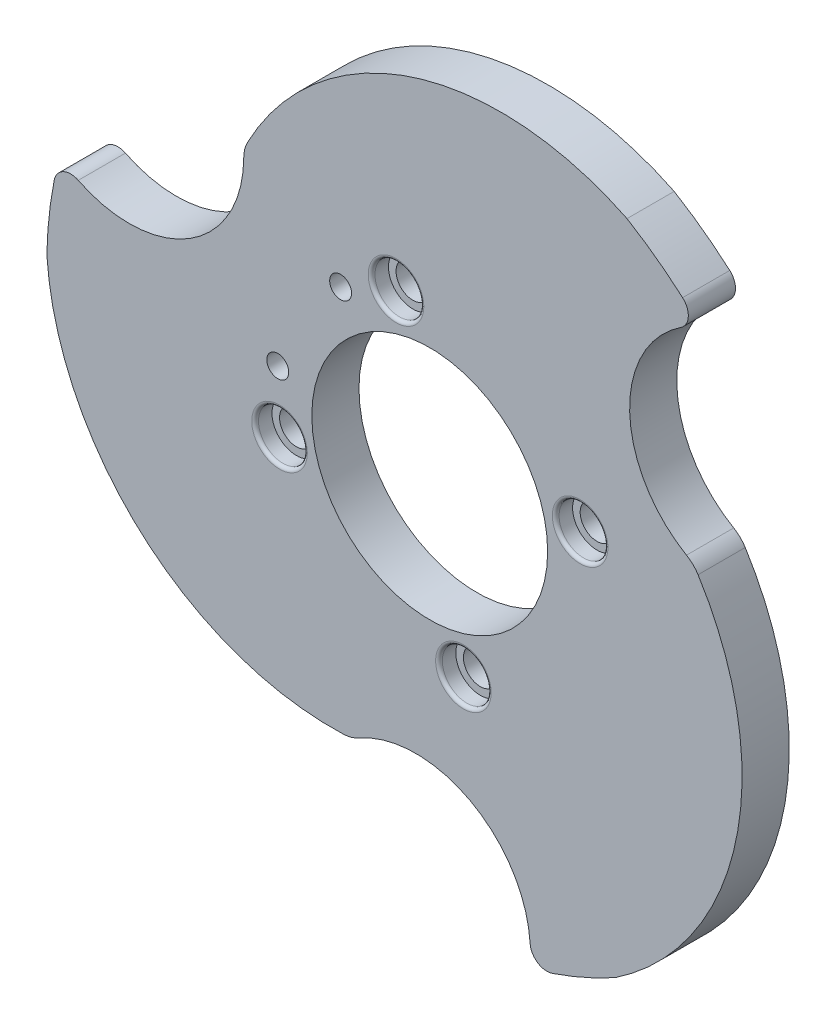
ISO-10303-21;
HEADER;
FILE_DESCRIPTION(('STEP AP214'),'2;1');
FILE_NAME('part.step','',(''),(''),'','','');
FILE_SCHEMA(('AUTOMOTIVE_DESIGN { 1 0 10303 214 1 1 1 1 }'));
ENDSEC;
DATA;
#1=APPLICATION_CONTEXT('core data for automotive mechanical design processes');
#2=APPLICATION_PROTOCOL_DEFINITION('international standard','automotive_design',2000,#1);
#3=PRODUCT_CONTEXT('',#1,'mechanical');
#4=PRODUCT('Part','Part','',(#3));
#5=PRODUCT_RELATED_PRODUCT_CATEGORY('part','',(#4));
#6=PRODUCT_DEFINITION_FORMATION('','',#4);
#7=PRODUCT_DEFINITION_CONTEXT('part definition',#1,'design');
#8=PRODUCT_DEFINITION('design','',#6,#7);
#9=PRODUCT_DEFINITION_SHAPE('','',#8);
#10=(LENGTH_UNIT() NAMED_UNIT(*) SI_UNIT(.MILLI.,.METRE.));
#11=(NAMED_UNIT(*) PLANE_ANGLE_UNIT() SI_UNIT($,.RADIAN.));
#12=(NAMED_UNIT(*) SI_UNIT($,.STERADIAN.) SOLID_ANGLE_UNIT());
#13=UNCERTAINTY_MEASURE_WITH_UNIT(LENGTH_MEASURE(1.E-05),#10,'distance_accuracy_value','');
#14=(GEOMETRIC_REPRESENTATION_CONTEXT(3) GLOBAL_UNCERTAINTY_ASSIGNED_CONTEXT((#13)) GLOBAL_UNIT_ASSIGNED_CONTEXT((#10,
#11,#12)) REPRESENTATION_CONTEXT('',''));
#15=CARTESIAN_POINT('',(0.,0.,0.));
#16=DIRECTION('',(0.,0.,1.));
#17=DIRECTION('',(1.,0.,0.));
#18=AXIS2_PLACEMENT_3D('',#15,#16,#17);
#19=CARTESIAN_POINT('',(201.365841271707,125.88903642238,14.));
#20=DIRECTION('',(0.,0.,-1.));
#21=DIRECTION('',(-1.,0.,0.));
#22=AXIS2_PLACEMENT_3D('',#19,#20,#21);
#23=CYLINDRICAL_SURFACE('',#22,4.99999999999999);
#24=CARTESIAN_POINT('',(201.365841271707,125.88903642238,0.));
#25=DIRECTION('',(0.,0.,1.));
#26=DIRECTION('',(1.,0.,0.));
#27=AXIS2_PLACEMENT_3D('',#24,#25,#26);
#28=CIRCLE('',#27,4.99999999999999);
#29=CARTESIAN_POINT('',(206.365841271707,125.88903642238,0.));
#30=VERTEX_POINT('',#29);
#31=EDGE_CURVE('E278',#30,#30,#28,.T.);
#32=ORIENTED_EDGE('',*,*,#31,.F.);
#33=EDGE_LOOP('',(#32));
#34=FACE_BOUND('',#33,.T.);
#35=CARTESIAN_POINT('',(201.365841271707,125.88903642238,9.));
#36=DIRECTION('',(0.,0.,1.));
#37=DIRECTION('',(1.,0.,0.));
#38=AXIS2_PLACEMENT_3D('',#35,#36,#37);
#39=CIRCLE('',#38,4.99999999999999);
#40=CARTESIAN_POINT('',(206.365841271707,125.88903642238,9.));
#41=VERTEX_POINT('',#40);
#42=EDGE_CURVE('E205',#41,#41,#39,.T.);
#43=ORIENTED_EDGE('',*,*,#42,.T.);
#44=EDGE_LOOP('',(#43));
#45=FACE_BOUND('',#44,.T.);
#46=ADVANCED_FACE('F43',(#34,#45),#23,.F.);
#47=CARTESIAN_POINT('',(166.72361372553,71.2443562546007,14.));
#48=DIRECTION('',(0.,0.,-1.));
#49=DIRECTION('',(-1.,0.,0.));
#50=AXIS2_PLACEMENT_3D('',#47,#48,#49);
#51=CYLINDRICAL_SURFACE('',#50,5.00000000000002);
#52=CARTESIAN_POINT('',(166.72361372553,71.2443562546007,0.));
#53=DIRECTION('',(0.,0.,1.));
#54=DIRECTION('',(1.,0.,0.));
#55=AXIS2_PLACEMENT_3D('',#52,#53,#54);
#56=CIRCLE('',#55,5.00000000000002);
#57=CARTESIAN_POINT('',(171.72361372553,71.2443562546007,0.));
#58=VERTEX_POINT('',#57);
#59=EDGE_CURVE('E270',#58,#58,#56,.T.);
#60=ORIENTED_EDGE('',*,*,#59,.F.);
#61=EDGE_LOOP('',(#60));
#62=FACE_BOUND('',#61,.T.);
#63=CARTESIAN_POINT('',(166.72361372553,71.2443562546007,9.));
#64=DIRECTION('',(0.,0.,1.));
#65=DIRECTION('',(1.,0.,0.));
#66=AXIS2_PLACEMENT_3D('',#63,#64,#65);
#67=CIRCLE('',#66,5.00000000000002);
#68=CARTESIAN_POINT('',(171.72361372553,71.2443562546007,9.));
#69=VERTEX_POINT('',#68);
#70=EDGE_CURVE('E335',#69,#69,#67,.T.);
#71=ORIENTED_EDGE('',*,*,#70,.T.);
#72=EDGE_LOOP('',(#71));
#73=FACE_BOUND('',#72,.T.);
#74=ADVANCED_FACE('F385',(#62,#73),#51,.F.);
#75=CARTESIAN_POINT('',(112.146853606545,105.588087507769,14.));
#76=DIRECTION('',(0.,0.,-1.));
#77=DIRECTION('',(-1.,0.,0.));
#78=AXIS2_PLACEMENT_3D('',#75,#76,#77);
#79=CYLINDRICAL_SURFACE('',#78,5.00000000000001);
#80=CARTESIAN_POINT('',(112.146853606545,105.588087507769,0.));
#81=DIRECTION('',(0.,0.,1.));
#82=DIRECTION('',(1.,0.,0.));
#83=AXIS2_PLACEMENT_3D('',#80,#81,#82);
#84=CIRCLE('',#83,5.00000000000001);
#85=CARTESIAN_POINT('',(117.146853606545,105.588087507769,0.));
#86=VERTEX_POINT('',#85);
#87=EDGE_CURVE('E266',#86,#86,#84,.T.);
#88=ORIENTED_EDGE('',*,*,#87,.F.);
#89=EDGE_LOOP('',(#88));
#90=FACE_BOUND('',#89,.T.);
#91=CARTESIAN_POINT('',(112.146853606545,105.588087507769,9.));
#92=DIRECTION('',(0.,0.,1.));
#93=DIRECTION('',(1.,0.,0.));
#94=AXIS2_PLACEMENT_3D('',#91,#92,#93);
#95=CIRCLE('',#94,5.00000000000001);
#96=CARTESIAN_POINT('',(117.146853606545,105.588087507769,9.));
#97=VERTEX_POINT('',#96);
#98=EDGE_CURVE('E330',#97,#97,#95,.T.);
#99=ORIENTED_EDGE('',*,*,#98,.T.);
#100=EDGE_LOOP('',(#99));
#101=FACE_BOUND('',#100,.T.);
#102=ADVANCED_FACE('F391',(#90,#101),#79,.F.);
#103=CARTESIAN_POINT('',(146.721161103928,160.531263968557,14.));
#104=DIRECTION('',(0.,0.,-1.));
#105=DIRECTION('',(-1.,0.,0.));
#106=AXIS2_PLACEMENT_3D('',#103,#104,#105);
#107=CYLINDRICAL_SURFACE('',#106,5.00000000000002);
#108=CARTESIAN_POINT('',(146.721161103928,160.531263968557,0.));
#109=DIRECTION('',(0.,0.,1.));
#110=DIRECTION('',(1.,0.,0.));
#111=AXIS2_PLACEMENT_3D('',#108,#109,#110);
#112=CIRCLE('',#111,5.00000000000002);
#113=CARTESIAN_POINT('',(151.721161103928,160.531263968557,0.));
#114=VERTEX_POINT('',#113);
#115=EDGE_CURVE('E262',#114,#114,#112,.T.);
#116=ORIENTED_EDGE('',*,*,#115,.F.);
#117=EDGE_LOOP('',(#116));
#118=FACE_BOUND('',#117,.T.);
#119=CARTESIAN_POINT('',(146.721161103928,160.531263968557,9.));
#120=DIRECTION('',(0.,0.,1.));
#121=DIRECTION('',(1.,0.,0.));
#122=AXIS2_PLACEMENT_3D('',#119,#120,#121);
#123=CIRCLE('',#122,5.00000000000002);
#124=CARTESIAN_POINT('',(151.721161103928,160.531263968557,9.));
#125=VERTEX_POINT('',#124);
#126=EDGE_CURVE('E326',#125,#125,#123,.T.);
#127=ORIENTED_EDGE('',*,*,#126,.T.);
#128=EDGE_LOOP('',(#127));
#129=FACE_BOUND('',#128,.T.);
#130=ADVANCED_FACE('F407',(#118,#129),#107,.F.);
#131=CARTESIAN_POINT('',(130.744813143606,48.6920471136725,14.));
#132=DIRECTION('',(0.,0.,-1.));
#133=DIRECTION('',(-1.,0.,0.));
#134=AXIS2_PLACEMENT_3D('',#131,#132,#133);
#135=CYLINDRICAL_SURFACE('',#134,10.);
#136=CARTESIAN_POINT('',(130.744813143606,48.6920471136725,0.));
#137=DIRECTION('',(0.,0.,1.));
#138=DIRECTION('',(1.,0.,0.));
#139=AXIS2_PLACEMENT_3D('',#136,#137,#138);
#140=CIRCLE('',#139,10.);
#141=CARTESIAN_POINT('',(135.711956254426,40.0129060665047,0.));
#142=VERTEX_POINT('',#141);
#143=CARTESIAN_POINT('',(131.125704093474,38.6993036423175,0.));
#144=VERTEX_POINT('',#143);
#145=EDGE_CURVE('E201',#142,#144,#140,.F.);
#146=ORIENTED_EDGE('',*,*,#145,.F.);
#147=DIRECTION('',(0.,0.,-1.));
#148=VECTOR('',#147,1.);
#149=CARTESIAN_POINT('',(135.711956254426,40.0129060665047,14.));
#150=LINE('',#149,#148);
#151=CARTESIAN_POINT('',(135.711956254426,40.0129060665047,14.));
#152=VERTEX_POINT('',#151);
#153=EDGE_CURVE('E118',#152,#142,#150,.T.);
#154=ORIENTED_EDGE('',*,*,#153,.F.);
#155=CARTESIAN_POINT('',(130.744813143606,48.6920471136725,14.));
#156=DIRECTION('',(0.,0.,1.));
#157=DIRECTION('',(1.,0.,0.));
#158=AXIS2_PLACEMENT_3D('',#155,#156,#157);
#159=CIRCLE('',#158,10.);
#160=CARTESIAN_POINT('',(131.125704093474,38.6993036423175,14.));
#161=VERTEX_POINT('',#160);
#162=EDGE_CURVE('E286',#152,#161,#159,.F.);
#163=ORIENTED_EDGE('',*,*,#162,.T.);
#164=DIRECTION('',(0.,0.,-1.));
#165=VECTOR('',#164,1.);
#166=CARTESIAN_POINT('',(131.125704093474,38.6993036423175,14.));
#167=LINE('',#166,#165);
#168=EDGE_CURVE('E61',#161,#144,#167,.T.);
#169=ORIENTED_EDGE('',*,*,#168,.T.);
#170=EDGE_LOOP('',(#146,#154,#163,#169));
#171=FACE_BOUND('',#170,.T.);
#172=ADVANCED_FACE('F411',(#171),#135,.T.);
#173=CARTESIAN_POINT('',(152.594956260523,10.5130637863279,14.));
#174=DIRECTION('',(0.,0.,-1.));
#175=DIRECTION('',(-1.,0.,0.));
#176=AXIS2_PLACEMENT_3D('',#173,#174,#175);
#177=CYLINDRICAL_SURFACE('',#176,33.989356918912);
#178=CARTESIAN_POINT('',(152.594956260523,10.5130637863279,0.));
#179=DIRECTION('',(0.,0.,1.));
#180=DIRECTION('',(1.,0.,0.));
#181=AXIS2_PLACEMENT_3D('',#178,#179,#180);
#182=CIRCLE('',#181,33.989356918912);
#183=CARTESIAN_POINT('',(186.517886141237,12.6370251959043,0.));
#184=VERTEX_POINT('',#183);
#185=EDGE_CURVE('E204',#184,#142,#182,.T.);
#186=ORIENTED_EDGE('',*,*,#185,.F.);
#187=DIRECTION('',(0.,0.,-1.));
#188=VECTOR('',#187,1.);
#189=CARTESIAN_POINT('',(186.517886141237,12.6370251959043,14.));
#190=LINE('',#189,#188);
#191=CARTESIAN_POINT('',(186.517886141237,12.6370251959043,14.));
#192=VERTEX_POINT('',#191);
#193=EDGE_CURVE('E320',#192,#184,#190,.T.);
#194=ORIENTED_EDGE('',*,*,#193,.F.);
#195=CARTESIAN_POINT('',(152.594956260523,10.5130637863279,14.));
#196=DIRECTION('',(0.,0.,1.));
#197=DIRECTION('',(1.,0.,0.));
#198=AXIS2_PLACEMENT_3D('',#195,#196,#197);
#199=CIRCLE('',#198,33.989356918912);
#200=EDGE_CURVE('E506',#192,#152,#199,.T.);
#201=ORIENTED_EDGE('',*,*,#200,.T.);
#202=ORIENTED_EDGE('',*,*,#153,.T.);
#203=EDGE_LOOP('',(#186,#194,#201,#202));
#204=FACE_BOUND('',#203,.T.);
#205=ADVANCED_FACE('F462',(#204),#177,.F.);
#206=CARTESIAN_POINT('',(191.508114400283,12.9494702672605,14.));
#207=DIRECTION('',(0.,0.,-1.));
#208=DIRECTION('',(-1.,0.,0.));
#209=AXIS2_PLACEMENT_3D('',#206,#207,#208);
#210=CYLINDRICAL_SURFACE('',#209,4.99999999999999);
#211=CARTESIAN_POINT('',(191.508114400283,12.9494702672605,0.));
#212=DIRECTION('',(0.,0.,1.));
#213=DIRECTION('',(1.,0.,0.));
#214=AXIS2_PLACEMENT_3D('',#211,#212,#213);
#215=CIRCLE('',#214,4.99999999999999);
#216=CARTESIAN_POINT('',(193.108826718608,8.2126232068241,0.));
#217=VERTEX_POINT('',#216);
#218=EDGE_CURVE('E209',#217,#184,#215,.F.);
#219=ORIENTED_EDGE('',*,*,#218,.F.);
#220=DIRECTION('',(0.,0.,-1.));
#221=VECTOR('',#220,1.);
#222=CARTESIAN_POINT('',(193.108826718608,8.2126232068241,14.));
#223=LINE('',#222,#221);
#224=CARTESIAN_POINT('',(193.108826718608,8.2126232068241,14.));
#225=VERTEX_POINT('',#224);
#226=EDGE_CURVE('E317',#225,#217,#223,.T.);
#227=ORIENTED_EDGE('',*,*,#226,.F.);
#228=CARTESIAN_POINT('',(191.508114400283,12.9494702672605,14.));
#229=DIRECTION('',(0.,0.,1.));
#230=DIRECTION('',(1.,0.,0.));
#231=AXIS2_PLACEMENT_3D('',#228,#229,#230);
#232=CIRCLE('',#231,4.99999999999999);
#233=EDGE_CURVE('E510',#225,#192,#232,.F.);
#234=ORIENTED_EDGE('',*,*,#233,.T.);
#235=ORIENTED_EDGE('',*,*,#193,.T.);
#236=EDGE_LOOP('',(#219,#227,#234,#235));
#237=FACE_BOUND('',#236,.T.);
#238=ADVANCED_FACE('F458',(#237),#210,.T.);
#239=CARTESIAN_POINT('',(156.722387414729,115.887810111579,14.));
#240=DIRECTION('',(0.,0.,-1.));
#241=DIRECTION('',(-1.,0.,0.));
#242=AXIS2_PLACEMENT_3D('',#239,#240,#241);
#243=CYLINDRICAL_SURFACE('',#242,113.657022837081);
#244=CARTESIAN_POINT('',(156.722387414729,115.887810111579,0.));
#245=DIRECTION('',(0.,0.,1.));
#246=DIRECTION('',(1.,0.,0.));
#247=AXIS2_PLACEMENT_3D('',#244,#245,#246);
#248=CIRCLE('',#247,113.657022837081);
#249=CARTESIAN_POINT('',(211.811443049201,16.4739539873407,0.));
#250=VERTEX_POINT('',#249);
#251=EDGE_CURVE('E213',#217,#250,#248,.T.);
#252=ORIENTED_EDGE('',*,*,#251,.T.);
#253=DIRECTION('',(0.,0.,-1.));
#254=VECTOR('',#253,1.);
#255=CARTESIAN_POINT('',(211.811443049201,16.4739539873407,14.));
#256=LINE('',#255,#254);
#257=CARTESIAN_POINT('',(211.811443049201,16.4739539873407,14.));
#258=VERTEX_POINT('',#257);
#259=EDGE_CURVE('E314',#258,#250,#256,.T.);
#260=ORIENTED_EDGE('',*,*,#259,.F.);
#261=CARTESIAN_POINT('',(156.722387414729,115.887810111579,14.));
#262=DIRECTION('',(0.,0.,1.));
#263=DIRECTION('',(1.,0.,0.));
#264=AXIS2_PLACEMENT_3D('',#261,#262,#263);
#265=CIRCLE('',#264,113.657022837081);
#266=EDGE_CURVE('E514',#225,#258,#265,.T.);
#267=ORIENTED_EDGE('',*,*,#266,.F.);
#268=ORIENTED_EDGE('',*,*,#226,.T.);
#269=EDGE_LOOP('',(#252,#260,#267,#268));
#270=FACE_BOUND('',#269,.T.);
#271=ADVANCED_FACE('F454',(#270),#243,.T.);
#272=CARTESIAN_POINT('',(164.427980647452,87.0417050555314,14.));
#273=DIRECTION('',(0.,0.,-1.));
#274=DIRECTION('',(-1.,0.,0.));
#275=AXIS2_PLACEMENT_3D('',#272,#273,#274);
#276=CYLINDRICAL_SURFACE('',#275,85.0000000000005);
#277=CARTESIAN_POINT('',(164.427980647452,87.0417050555314,0.));
#278=DIRECTION('',(0.,0.,1.));
#279=DIRECTION('',(1.,0.,0.));
#280=AXIS2_PLACEMENT_3D('',#277,#278,#279);
#281=CIRCLE('',#280,85.0000000000005);
#282=CARTESIAN_POINT('',(236.367936557918,132.314685337376,0.));
#283=VERTEX_POINT('',#282);
#284=EDGE_CURVE('E217',#283,#250,#281,.F.);
#285=ORIENTED_EDGE('',*,*,#284,.F.);
#286=DIRECTION('',(0.,0.,-1.));
#287=VECTOR('',#286,1.);
#288=CARTESIAN_POINT('',(236.367936557918,132.314685337376,14.));
#289=LINE('',#288,#287);
#290=CARTESIAN_POINT('',(236.367936557918,132.314685337376,14.));
#291=VERTEX_POINT('',#290);
#292=EDGE_CURVE('E311',#291,#283,#289,.T.);
#293=ORIENTED_EDGE('',*,*,#292,.F.);
#294=CARTESIAN_POINT('',(164.427980647452,87.0417050555314,14.));
#295=DIRECTION('',(0.,0.,1.));
#296=DIRECTION('',(1.,0.,0.));
#297=AXIS2_PLACEMENT_3D('',#294,#295,#296);
#298=CIRCLE('',#297,85.0000000000005);
#299=EDGE_CURVE('E517',#291,#258,#298,.F.);
#300=ORIENTED_EDGE('',*,*,#299,.T.);
#301=ORIENTED_EDGE('',*,*,#259,.T.);
#302=EDGE_LOOP('',(#285,#293,#300,#301));
#303=FACE_BOUND('',#302,.T.);
#304=ADVANCED_FACE('F450',(#303),#276,.T.);
#305=CARTESIAN_POINT('',(227.904412333157,126.988452363041,14.));
#306=DIRECTION('',(0.,0.,-1.));
#307=DIRECTION('',(-1.,0.,0.));
#308=AXIS2_PLACEMENT_3D('',#305,#306,#307);
#309=CYLINDRICAL_SURFACE('',#308,10.);
#310=CARTESIAN_POINT('',(227.904412333157,126.988452363041,0.));
#311=DIRECTION('',(0.,0.,1.));
#312=DIRECTION('',(1.,0.,0.));
#313=AXIS2_PLACEMENT_3D('',#310,#311,#312);
#314=CIRCLE('',#313,10.);
#315=CARTESIAN_POINT('',(232.937197407622,135.629695004828,0.));
#316=VERTEX_POINT('',#315);
#317=EDGE_CURVE('E221',#316,#283,#314,.F.);
#318=ORIENTED_EDGE('',*,*,#317,.F.);
#319=DIRECTION('',(0.,0.,-1.));
#320=VECTOR('',#319,1.);
#321=CARTESIAN_POINT('',(232.937197407622,135.629695004828,14.));
#322=LINE('',#321,#320);
#323=CARTESIAN_POINT('',(232.937197407622,135.629695004828,14.));
#324=VERTEX_POINT('',#323);
#325=EDGE_CURVE('E308',#324,#316,#322,.T.);
#326=ORIENTED_EDGE('',*,*,#325,.F.);
#327=CARTESIAN_POINT('',(227.904412333157,126.988452363041,14.));
#328=DIRECTION('',(0.,0.,1.));
#329=DIRECTION('',(1.,0.,0.));
#330=AXIS2_PLACEMENT_3D('',#327,#328,#329);
#331=CIRCLE('',#330,10.);
#332=EDGE_CURVE('E521',#324,#291,#331,.F.);
#333=ORIENTED_EDGE('',*,*,#332,.T.);
#334=ORIENTED_EDGE('',*,*,#292,.T.);
#335=EDGE_LOOP('',(#318,#326,#333,#334));
#336=FACE_BOUND('',#335,.T.);
#337=ADVANCED_FACE('F446',(#336),#309,.T.);
#338=CARTESIAN_POINT('',(250.04331022684,165.00072304229,14.));
#339=DIRECTION('',(0.,0.,-1.));
#340=DIRECTION('',(-1.,0.,0.));
#341=AXIS2_PLACEMENT_3D('',#338,#339,#340);
#342=CYLINDRICAL_SURFACE('',#341,33.989356918912);
#343=CARTESIAN_POINT('',(250.04331022684,165.00072304229,0.));
#344=DIRECTION('',(0.,0.,1.));
#345=DIRECTION('',(1.,0.,0.));
#346=AXIS2_PLACEMENT_3D('',#343,#344,#345);
#347=CIRCLE('',#346,33.989356918912);
#348=CARTESIAN_POINT('',(231.242440749132,193.316861384998,0.));
#349=VERTEX_POINT('',#348);
#350=EDGE_CURVE('E225',#349,#316,#347,.T.);
#351=ORIENTED_EDGE('',*,*,#350,.F.);
#352=DIRECTION('',(0.,0.,-1.));
#353=VECTOR('',#352,1.);
#354=CARTESIAN_POINT('',(231.242440749132,193.316861384998,14.));
#355=LINE('',#354,#353);
#356=CARTESIAN_POINT('',(231.242440749132,193.316861384998,14.));
#357=VERTEX_POINT('',#356);
#358=EDGE_CURVE('E305',#357,#349,#355,.T.);
#359=ORIENTED_EDGE('',*,*,#358,.F.);
#360=CARTESIAN_POINT('',(250.04331022684,165.00072304229,14.));
#361=DIRECTION('',(0.,0.,1.));
#362=DIRECTION('',(1.,0.,0.));
#363=AXIS2_PLACEMENT_3D('',#360,#361,#362);
#364=CIRCLE('',#363,33.989356918912);
#365=EDGE_CURVE('E525',#357,#324,#364,.T.);
#366=ORIENTED_EDGE('',*,*,#365,.T.);
#367=ORIENTED_EDGE('',*,*,#325,.T.);
#368=EDGE_LOOP('',(#351,#359,#366,#367));
#369=FACE_BOUND('',#368,.T.);
#370=ADVANCED_FACE('F442',(#369),#342,.F.);
#371=CARTESIAN_POINT('',(228.476741250527,197.482303292337,14.));
#372=DIRECTION('',(0.,0.,-1.));
#373=DIRECTION('',(-1.,0.,0.));
#374=AXIS2_PLACEMENT_3D('',#371,#372,#373);
#375=CYLINDRICAL_SURFACE('',#374,5.);
#376=CARTESIAN_POINT('',(228.476741250527,197.482303292337,0.));
#377=DIRECTION('',(0.,0.,1.));
#378=DIRECTION('',(1.,0.,0.));
#379=AXIS2_PLACEMENT_3D('',#376,#377,#378);
#380=CIRCLE('',#379,5.);
#381=CARTESIAN_POINT('',(231.778614979545,201.236984354375,0.));
#382=VERTEX_POINT('',#381);
#383=EDGE_CURVE('E229',#382,#349,#380,.F.);
#384=ORIENTED_EDGE('',*,*,#383,.F.);
#385=DIRECTION('',(0.,0.,-1.));
#386=VECTOR('',#385,1.);
#387=CARTESIAN_POINT('',(231.778614979545,201.236984354375,14.));
#388=LINE('',#387,#386);
#389=CARTESIAN_POINT('',(231.778614979545,201.236984354375,14.));
#390=VERTEX_POINT('',#389);
#391=EDGE_CURVE('E302',#390,#382,#388,.T.);
#392=ORIENTED_EDGE('',*,*,#391,.F.);
#393=CARTESIAN_POINT('',(228.476741250527,197.482303292337,14.));
#394=DIRECTION('',(0.,0.,1.));
#395=DIRECTION('',(1.,0.,0.));
#396=AXIS2_PLACEMENT_3D('',#393,#394,#395);
#397=CIRCLE('',#396,5.);
#398=EDGE_CURVE('E529',#390,#357,#397,.F.);
#399=ORIENTED_EDGE('',*,*,#398,.T.);
#400=ORIENTED_EDGE('',*,*,#358,.T.);
#401=EDGE_LOOP('',(#384,#392,#399,#400));
#402=FACE_BOUND('',#401,.T.);
#403=ADVANCED_FACE('F438',(#402),#375,.T.);
#404=CARTESIAN_POINT('',(156.722387414729,115.887810111579,14.));
#405=DIRECTION('',(0.,0.,-1.));
#406=DIRECTION('',(-1.,0.,0.));
#407=AXIS2_PLACEMENT_3D('',#404,#405,#406);
#408=CYLINDRICAL_SURFACE('',#407,113.65702283708);
#409=CARTESIAN_POINT('',(156.722387414729,115.887810111579,0.));
#410=DIRECTION('',(0.,0.,1.));
#411=DIRECTION('',(1.,0.,0.));
#412=AXIS2_PLACEMENT_3D('',#409,#410,#411);
#413=CIRCLE('',#412,113.65702283708);
#414=CARTESIAN_POINT('',(215.272784489254,213.303259823644,0.));
#415=VERTEX_POINT('',#414);
#416=EDGE_CURVE('E233',#382,#415,#413,.T.);
#417=ORIENTED_EDGE('',*,*,#416,.T.);
#418=DIRECTION('',(0.,0.,-1.));
#419=VECTOR('',#418,1.);
#420=CARTESIAN_POINT('',(215.272784489254,213.303259823644,14.));
#421=LINE('',#420,#419);
#422=CARTESIAN_POINT('',(215.272784489254,213.303259823644,14.));
#423=VERTEX_POINT('',#422);
#424=EDGE_CURVE('E299',#423,#415,#421,.T.);
#425=ORIENTED_EDGE('',*,*,#424,.F.);
#426=CARTESIAN_POINT('',(156.722387414729,115.887810111579,14.));
#427=DIRECTION('',(0.,0.,1.));
#428=DIRECTION('',(1.,0.,0.));
#429=AXIS2_PLACEMENT_3D('',#426,#427,#428);
#430=CIRCLE('',#429,113.65702283708);
#431=EDGE_CURVE('E533',#390,#423,#430,.T.);
#432=ORIENTED_EDGE('',*,*,#431,.F.);
#433=ORIENTED_EDGE('',*,*,#391,.T.);
#434=EDGE_LOOP('',(#417,#425,#432,#433));
#435=FACE_BOUND('',#434,.T.);
#436=ADVANCED_FACE('F434',(#435),#408,.T.);
#437=CARTESIAN_POINT('',(177.851050577139,136.98410213037,14.));
#438=DIRECTION('',(0.,0.,-1.));
#439=DIRECTION('',(-1.,0.,0.));
#440=AXIS2_PLACEMENT_3D('',#437,#438,#439);
#441=CYLINDRICAL_SURFACE('',#440,85.);
#442=CARTESIAN_POINT('',(177.851050577139,136.98410213037,0.));
#443=DIRECTION('',(0.,0.,1.));
#444=DIRECTION('',(1.,0.,0.));
#445=AXIS2_PLACEMENT_3D('',#442,#443,#444);
#446=CIRCLE('',#445,85.);
#447=CARTESIAN_POINT('',(102.673521592798,176.649441355046,0.));
#448=VERTEX_POINT('',#447);
#449=EDGE_CURVE('E237',#448,#415,#446,.F.);
#450=ORIENTED_EDGE('',*,*,#449,.F.);
#451=DIRECTION('',(0.,0.,-1.));
#452=VECTOR('',#451,1.);
#453=CARTESIAN_POINT('',(102.673521592798,176.649441355046,14.));
#454=LINE('',#453,#452);
#455=CARTESIAN_POINT('',(102.673521592798,176.649441355046,14.));
#456=VERTEX_POINT('',#455);
#457=EDGE_CURVE('E296',#456,#448,#454,.T.);
#458=ORIENTED_EDGE('',*,*,#457,.F.);
#459=CARTESIAN_POINT('',(177.851050577139,136.98410213037,14.));
#460=DIRECTION('',(0.,0.,1.));
#461=DIRECTION('',(1.,0.,0.));
#462=AXIS2_PLACEMENT_3D('',#459,#460,#461);
#463=CIRCLE('',#462,85.);
#464=EDGE_CURVE('E536',#456,#423,#463,.F.);
#465=ORIENTED_EDGE('',*,*,#464,.T.);
#466=ORIENTED_EDGE('',*,*,#424,.T.);
#467=EDGE_LOOP('',(#450,#458,#465,#466));
#468=FACE_BOUND('',#467,.T.);
#469=ADVANCED_FACE('F430',(#468),#441,.T.);
#470=CARTESIAN_POINT('',(111.517936767427,171.982930858025,14.));
#471=DIRECTION('',(0.,0.,-1.));
#472=DIRECTION('',(-1.,0.,0.));
#473=AXIS2_PLACEMENT_3D('',#470,#471,#472);
#474=CYLINDRICAL_SURFACE('',#473,10.);
#475=CARTESIAN_POINT('',(111.517936767427,171.982930858025,0.));
#476=DIRECTION('',(0.,0.,1.));
#477=DIRECTION('',(1.,0.,0.));
#478=AXIS2_PLACEMENT_3D('',#475,#476,#477);
#479=CIRCLE('',#478,10.);
#480=CARTESIAN_POINT('',(101.518008582141,172.020829263405,0.));
#481=VERTEX_POINT('',#480);
#482=EDGE_CURVE('E241',#448,#481,#479,.T.);
#483=ORIENTED_EDGE('',*,*,#482,.T.);
#484=DIRECTION('',(0.,0.,-1.));
#485=VECTOR('',#484,1.);
#486=CARTESIAN_POINT('',(101.518008582141,172.020829263405,14.));
#487=LINE('',#486,#485);
#488=CARTESIAN_POINT('',(101.518008582141,172.020829263405,14.));
#489=VERTEX_POINT('',#488);
#490=EDGE_CURVE('E293',#489,#481,#487,.T.);
#491=ORIENTED_EDGE('',*,*,#490,.F.);
#492=CARTESIAN_POINT('',(111.517936767427,171.982930858025,14.));
#493=DIRECTION('',(0.,0.,1.));
#494=DIRECTION('',(1.,0.,0.));
#495=AXIS2_PLACEMENT_3D('',#492,#493,#494);
#496=CIRCLE('',#495,10.);
#497=EDGE_CURVE('E183',#456,#489,#496,.T.);
#498=ORIENTED_EDGE('',*,*,#497,.F.);
#499=ORIENTED_EDGE('',*,*,#457,.T.);
#500=EDGE_LOOP('',(#483,#491,#498,#499));
#501=FACE_BOUND('',#500,.T.);
#502=ADVANCED_FACE('F426',(#501),#474,.T.);
#503=CARTESIAN_POINT('',(67.5288957568249,172.149643506118,14.));
#504=DIRECTION('',(0.,0.,-1.));
#505=DIRECTION('',(-1.,0.,0.));
#506=AXIS2_PLACEMENT_3D('',#503,#504,#505);
#507=CYLINDRICAL_SURFACE('',#506,33.989356918912);
#508=CARTESIAN_POINT('',(67.5288957568249,172.149643506118,0.));
#509=DIRECTION('',(0.,0.,1.));
#510=DIRECTION('',(1.,0.,0.));
#511=AXIS2_PLACEMENT_3D('',#508,#509,#510);
#512=CIRCLE('',#511,33.989356918912);
#513=CARTESIAN_POINT('',(52.4068353538188,141.709543753833,0.));
#514=VERTEX_POINT('',#513);
#515=EDGE_CURVE('E245',#514,#481,#512,.T.);
#516=ORIENTED_EDGE('',*,*,#515,.F.);
#517=DIRECTION('',(0.,0.,-1.));
#518=VECTOR('',#517,1.);
#519=CARTESIAN_POINT('',(52.4068353538188,141.709543753833,14.));
#520=LINE('',#519,#518);
#521=CARTESIAN_POINT('',(52.4068353538188,141.709543753833,14.));
#522=VERTEX_POINT('',#521);
#523=EDGE_CURVE('E166',#522,#514,#520,.T.);
#524=ORIENTED_EDGE('',*,*,#523,.F.);
#525=CARTESIAN_POINT('',(67.5288957568249,172.149643506118,14.));
#526=DIRECTION('',(0.,0.,1.));
#527=DIRECTION('',(1.,0.,0.));
#528=AXIS2_PLACEMENT_3D('',#525,#526,#527);
#529=CIRCLE('',#528,33.989356918912);
#530=EDGE_CURVE('E179',#522,#489,#529,.T.);
#531=ORIENTED_EDGE('',*,*,#530,.T.);
#532=ORIENTED_EDGE('',*,*,#490,.T.);
#533=EDGE_LOOP('',(#516,#524,#531,#532));
#534=FACE_BOUND('',#533,.T.);
#535=ADVANCED_FACE('F423',(#534),#507,.F.);
#536=CARTESIAN_POINT('',(50.1823065933774,137.231656775138,14.));
#537=DIRECTION('',(0.,0.,-1.));
#538=DIRECTION('',(-1.,0.,0.));
#539=AXIS2_PLACEMENT_3D('',#536,#537,#538);
#540=CYLINDRICAL_SURFACE('',#539,5.);
#541=CARTESIAN_POINT('',(50.1823065933774,137.231656775138,0.));
#542=DIRECTION('',(0.,0.,1.));
#543=DIRECTION('',(1.,0.,0.));
#544=AXIS2_PLACEMENT_3D('',#541,#542,#543);
#545=CIRCLE('',#544,5.);
#546=CARTESIAN_POINT('',(45.2797205460356,138.213822773537,0.));
#547=VERTEX_POINT('',#546);
#548=EDGE_CURVE('E162',#547,#514,#545,.F.);
#549=ORIENTED_EDGE('',*,*,#548,.F.);
#550=DIRECTION('',(0.,0.,-1.));
#551=VECTOR('',#550,1.);
#552=CARTESIAN_POINT('',(45.2797205460356,138.213822773537,14.));
#553=LINE('',#552,#551);
#554=CARTESIAN_POINT('',(45.2797205460356,138.213822773537,14.));
#555=VERTEX_POINT('',#554);
#556=EDGE_CURVE('E156',#555,#547,#553,.T.);
#557=ORIENTED_EDGE('',*,*,#556,.F.);
#558=CARTESIAN_POINT('',(50.1823065933774,137.231656775138,14.));
#559=DIRECTION('',(0.,0.,1.));
#560=DIRECTION('',(1.,0.,0.));
#561=AXIS2_PLACEMENT_3D('',#558,#559,#560);
#562=CIRCLE('',#561,5.);
#563=EDGE_CURVE('E160',#555,#522,#562,.F.);
#564=ORIENTED_EDGE('',*,*,#563,.T.);
#565=ORIENTED_EDGE('',*,*,#523,.T.);
#566=EDGE_LOOP('',(#549,#557,#564,#565));
#567=FACE_BOUND('',#566,.T.);
#568=ADVANCED_FACE('F158',(#567),#540,.T.);
#569=CARTESIAN_POINT('',(156.722387414729,115.887810111579,14.));
#570=DIRECTION('',(0.,0.,-1.));
#571=DIRECTION('',(-1.,0.,0.));
#572=AXIS2_PLACEMENT_3D('',#569,#570,#571);
#573=CYLINDRICAL_SURFACE('',#572,113.65702283708);
#574=CARTESIAN_POINT('',(156.722387414729,115.887810111579,0.));
#575=DIRECTION('',(0.,0.,1.));
#576=DIRECTION('',(1.,0.,0.));
#577=AXIS2_PLACEMENT_3D('',#574,#575,#576);
#578=CIRCLE('',#577,113.65702283708);
#579=CARTESIAN_POINT('',(43.0829347057321,117.886216523751,0.));
#580=VERTEX_POINT('',#579);
#581=EDGE_CURVE('E251',#547,#580,#578,.T.);
#582=ORIENTED_EDGE('',*,*,#581,.T.);
#583=DIRECTION('',(0.,0.,-1.));
#584=VECTOR('',#583,1.);
#585=CARTESIAN_POINT('',(43.0829347057321,117.886216523751,14.));
#586=LINE('',#585,#584);
#587=CARTESIAN_POINT('',(43.0829347057321,117.886216523751,14.));
#588=VERTEX_POINT('',#587);
#589=EDGE_CURVE('E109',#588,#580,#586,.T.);
#590=ORIENTED_EDGE('',*,*,#589,.F.);
#591=CARTESIAN_POINT('',(156.722387414729,115.887810111579,14.));
#592=DIRECTION('',(0.,0.,1.));
#593=DIRECTION('',(1.,0.,0.));
#594=AXIS2_PLACEMENT_3D('',#591,#592,#593);
#595=CIRCLE('',#594,113.65702283708);
#596=EDGE_CURVE('E168',#555,#588,#595,.T.);
#597=ORIENTED_EDGE('',*,*,#596,.F.);
#598=ORIENTED_EDGE('',*,*,#556,.T.);
#599=EDGE_LOOP('',(#582,#590,#597,#598));
#600=FACE_BOUND('',#599,.T.);
#601=ADVANCED_FACE('F169',(#600),#573,.T.);
#602=CARTESIAN_POINT('',(130.273826669254,153.217907010635,14.));
#603=DIRECTION('',(0.,0.,-1.));
#604=DIRECTION('',(-1.,0.,0.));
#605=AXIS2_PLACEMENT_3D('',#602,#603,#604);
#606=CYLINDRICAL_SURFACE('',#605,3.25000000000001);
#607=CARTESIAN_POINT('',(130.273826669254,153.217907010635,14.));
#608=DIRECTION('',(0.,0.,1.));
#609=DIRECTION('',(1.,0.,0.));
#610=AXIS2_PLACEMENT_3D('',#607,#608,#609);
#611=CIRCLE('',#610,3.25000000000001);
#612=CARTESIAN_POINT('',(133.523826669254,153.217907010635,14.));
#613=VERTEX_POINT('',#612);
#614=EDGE_CURVE('E193',#613,#613,#611,.T.);
#615=ORIENTED_EDGE('',*,*,#614,.T.);
#616=EDGE_LOOP('',(#615));
#617=FACE_BOUND('',#616,.T.);
#618=CARTESIAN_POINT('',(130.273826669254,153.217907010635,0.));
#619=DIRECTION('',(0.,0.,1.));
#620=DIRECTION('',(1.,0.,0.));
#621=AXIS2_PLACEMENT_3D('',#618,#619,#620);
#622=CIRCLE('',#621,3.25000000000001);
#623=CARTESIAN_POINT('',(133.523826669254,153.217907010635,0.));
#624=VERTEX_POINT('',#623);
#625=EDGE_CURVE('E274',#624,#624,#622,.T.);
#626=ORIENTED_EDGE('',*,*,#625,.F.);
#627=EDGE_LOOP('',(#626));
#628=FACE_BOUND('',#627,.T.);
#629=ADVANCED_FACE('F400',(#617,#628),#606,.F.);
#630=CARTESIAN_POINT('',(111.625067893257,123.588087507769,14.));
#631=DIRECTION('',(0.,0.,-1.));
#632=DIRECTION('',(-1.,0.,0.));
#633=AXIS2_PLACEMENT_3D('',#630,#631,#632);
#634=CYLINDRICAL_SURFACE('',#633,3.25000000000001);
#635=CARTESIAN_POINT('',(111.625067893257,123.588087507769,14.));
#636=DIRECTION('',(0.,0.,1.));
#637=DIRECTION('',(1.,0.,0.));
#638=AXIS2_PLACEMENT_3D('',#635,#636,#637);
#639=CIRCLE('',#638,3.25000000000001);
#640=CARTESIAN_POINT('',(114.875067893257,123.588087507769,14.));
#641=VERTEX_POINT('',#640);
#642=EDGE_CURVE('E189',#641,#641,#639,.T.);
#643=ORIENTED_EDGE('',*,*,#642,.T.);
#644=EDGE_LOOP('',(#643));
#645=FACE_BOUND('',#644,.T.);
#646=CARTESIAN_POINT('',(111.625067893257,123.588087507769,0.));
#647=DIRECTION('',(0.,0.,1.));
#648=DIRECTION('',(1.,0.,0.));
#649=AXIS2_PLACEMENT_3D('',#646,#647,#648);
#650=CIRCLE('',#649,3.25000000000001);
#651=CARTESIAN_POINT('',(114.875067893257,123.588087507769,0.));
#652=VERTEX_POINT('',#651);
#653=EDGE_CURVE('E258',#652,#652,#650,.T.);
#654=ORIENTED_EDGE('',*,*,#653,.F.);
#655=EDGE_LOOP('',(#654));
#656=FACE_BOUND('',#655,.T.);
#657=ADVANCED_FACE('F402',(#645,#656),#634,.F.);
#658=CARTESIAN_POINT('',(127.888131019595,123.637623148835,14.));
#659=DIRECTION('',(0.,0.,-1.));
#660=DIRECTION('',(-1.,0.,0.));
#661=AXIS2_PLACEMENT_3D('',#658,#659,#660);
#662=CYLINDRICAL_SURFACE('',#661,84.9999999999998);
#663=CARTESIAN_POINT('',(127.888131019595,123.637623148835,0.));
#664=DIRECTION('',(0.,0.,1.));
#665=DIRECTION('',(1.,0.,0.));
#666=AXIS2_PLACEMENT_3D('',#663,#664,#665);
#667=CIRCLE('',#666,84.9999999999998);
#668=EDGE_CURVE('E254',#144,#580,#667,.F.);
#669=ORIENTED_EDGE('',*,*,#668,.F.);
#670=ORIENTED_EDGE('',*,*,#168,.F.);
#671=CARTESIAN_POINT('',(127.888131019595,123.637623148835,14.));
#672=DIRECTION('',(0.,0.,1.));
#673=DIRECTION('',(1.,0.,0.));
#674=AXIS2_PLACEMENT_3D('',#671,#672,#673);
#675=CIRCLE('',#674,84.9999999999998);
#676=EDGE_CURVE('E173',#161,#588,#675,.F.);
#677=ORIENTED_EDGE('',*,*,#676,.T.);
#678=ORIENTED_EDGE('',*,*,#589,.T.);
#679=EDGE_LOOP('',(#669,#670,#677,#678));
#680=FACE_BOUND('',#679,.T.);
#681=ADVANCED_FACE('F415',(#680),#662,.T.);
#682=CARTESIAN_POINT('',(156.722387414729,115.887810111579,14.));
#683=DIRECTION('',(0.,0.,-1.));
#684=DIRECTION('',(-1.,0.,0.));
#685=AXIS2_PLACEMENT_3D('',#682,#683,#684);
#686=CYLINDRICAL_SURFACE('',#685,35.);
#687=CARTESIAN_POINT('',(156.722387414729,115.887810111579,14.));
#688=DIRECTION('',(0.,0.,1.));
#689=DIRECTION('',(1.,0.,0.));
#690=AXIS2_PLACEMENT_3D('',#687,#688,#689);
#691=CIRCLE('',#690,35.);
#692=CARTESIAN_POINT('',(191.722387414729,115.887810111579,14.));
#693=VERTEX_POINT('',#692);
#694=EDGE_CURVE('E197',#693,#693,#691,.T.);
#695=ORIENTED_EDGE('',*,*,#694,.T.);
#696=EDGE_LOOP('',(#695));
#697=FACE_BOUND('',#696,.T.);
#698=CARTESIAN_POINT('',(156.722387414729,115.887810111579,0.));
#699=DIRECTION('',(0.,0.,1.));
#700=DIRECTION('',(1.,0.,0.));
#701=AXIS2_PLACEMENT_3D('',#698,#699,#700);
#702=CIRCLE('',#701,35.);
#703=CARTESIAN_POINT('',(191.722387414729,115.887810111579,0.));
#704=VERTEX_POINT('',#703);
#705=EDGE_CURVE('E282',#704,#704,#702,.T.);
#706=ORIENTED_EDGE('',*,*,#705,.F.);
#707=EDGE_LOOP('',(#706));
#708=FACE_BOUND('',#707,.T.);
#709=ADVANCED_FACE('F398',(#697,#708),#686,.F.);
#710=CARTESIAN_POINT('',(0.,0.,14.));
#711=DIRECTION('',(0.,0.,1.));
#712=DIRECTION('',(1.,0.,0.));
#713=AXIS2_PLACEMENT_3D('',#710,#711,#712);
#714=PLANE('',#713);
#715=CARTESIAN_POINT('',(201.365841271707,125.88903642238,14.));
#716=DIRECTION('',(0.,0.,1.));
#717=DIRECTION('',(1.,0.,0.));
#718=AXIS2_PLACEMENT_3D('',#715,#716,#717);
#719=CIRCLE('',#718,8.25);
#720=CARTESIAN_POINT('',(209.615841271707,125.88903642238,14.));
#721=VERTEX_POINT('',#720);
#722=EDGE_CURVE('E357',#721,#721,#719,.F.);
#723=ORIENTED_EDGE('',*,*,#722,.T.);
#724=EDGE_LOOP('',(#723));
#725=FACE_BOUND('',#724,.T.);
#726=CARTESIAN_POINT('',(166.72361372553,71.2443562546007,14.));
#727=DIRECTION('',(0.,0.,1.));
#728=DIRECTION('',(1.,0.,0.));
#729=AXIS2_PLACEMENT_3D('',#726,#727,#728);
#730=CIRCLE('',#729,8.25);
#731=CARTESIAN_POINT('',(174.97361372553,71.2443562546007,14.));
#732=VERTEX_POINT('',#731);
#733=EDGE_CURVE('E353',#732,#732,#730,.F.);
#734=ORIENTED_EDGE('',*,*,#733,.T.);
#735=EDGE_LOOP('',(#734));
#736=FACE_BOUND('',#735,.T.);
#737=CARTESIAN_POINT('',(112.146853606545,105.588087507769,14.));
#738=DIRECTION('',(0.,0.,1.));
#739=DIRECTION('',(1.,0.,0.));
#740=AXIS2_PLACEMENT_3D('',#737,#738,#739);
#741=CIRCLE('',#740,8.25);
#742=CARTESIAN_POINT('',(120.396853606545,105.588087507769,14.));
#743=VERTEX_POINT('',#742);
#744=EDGE_CURVE('E349',#743,#743,#741,.F.);
#745=ORIENTED_EDGE('',*,*,#744,.T.);
#746=EDGE_LOOP('',(#745));
#747=FACE_BOUND('',#746,.T.);
#748=CARTESIAN_POINT('',(146.721161103928,160.531263968557,14.));
#749=DIRECTION('',(0.,0.,1.));
#750=DIRECTION('',(1.,0.,0.));
#751=AXIS2_PLACEMENT_3D('',#748,#749,#750);
#752=CIRCLE('',#751,8.25);
#753=CARTESIAN_POINT('',(154.971161103928,160.531263968557,14.));
#754=VERTEX_POINT('',#753);
#755=EDGE_CURVE('E345',#754,#754,#752,.F.);
#756=ORIENTED_EDGE('',*,*,#755,.T.);
#757=EDGE_LOOP('',(#756));
#758=FACE_BOUND('',#757,.T.);
#759=ORIENTED_EDGE('',*,*,#162,.F.);
#760=ORIENTED_EDGE('',*,*,#200,.F.);
#761=ORIENTED_EDGE('',*,*,#233,.F.);
#762=ORIENTED_EDGE('',*,*,#266,.T.);
#763=ORIENTED_EDGE('',*,*,#299,.F.);
#764=ORIENTED_EDGE('',*,*,#332,.F.);
#765=ORIENTED_EDGE('',*,*,#365,.F.);
#766=ORIENTED_EDGE('',*,*,#398,.F.);
#767=ORIENTED_EDGE('',*,*,#431,.T.);
#768=ORIENTED_EDGE('',*,*,#464,.F.);
#769=ORIENTED_EDGE('',*,*,#497,.T.);
#770=ORIENTED_EDGE('',*,*,#530,.F.);
#771=ORIENTED_EDGE('',*,*,#563,.F.);
#772=ORIENTED_EDGE('',*,*,#596,.T.);
#773=ORIENTED_EDGE('',*,*,#676,.F.);
#774=EDGE_LOOP('',(#759,#760,#761,#762,#763,#764,#765,#766,#767,#768,#769,#770,#771,#772,#773));
#775=FACE_BOUND('',#774,.T.);
#776=ORIENTED_EDGE('',*,*,#642,.F.);
#777=EDGE_LOOP('',(#776));
#778=FACE_BOUND('',#777,.T.);
#779=ORIENTED_EDGE('',*,*,#614,.F.);
#780=EDGE_LOOP('',(#779));
#781=FACE_BOUND('',#780,.T.);
#782=ORIENTED_EDGE('',*,*,#694,.F.);
#783=EDGE_LOOP('',(#782));
#784=FACE_BOUND('',#783,.T.);
#785=ADVANCED_FACE('F176',(#725,#736,#747,#758,#775,#778,#781,#784),#714,.T.);
#786=CARTESIAN_POINT('',(0.,0.,0.));
#787=DIRECTION('',(0.,0.,1.));
#788=DIRECTION('',(1.,0.,0.));
#789=AXIS2_PLACEMENT_3D('',#786,#787,#788);
#790=PLANE('',#789);
#791=ORIENTED_EDGE('',*,*,#145,.T.);
#792=ORIENTED_EDGE('',*,*,#668,.T.);
#793=ORIENTED_EDGE('',*,*,#581,.F.);
#794=ORIENTED_EDGE('',*,*,#548,.T.);
#795=ORIENTED_EDGE('',*,*,#515,.T.);
#796=ORIENTED_EDGE('',*,*,#482,.F.);
#797=ORIENTED_EDGE('',*,*,#449,.T.);
#798=ORIENTED_EDGE('',*,*,#416,.F.);
#799=ORIENTED_EDGE('',*,*,#383,.T.);
#800=ORIENTED_EDGE('',*,*,#350,.T.);
#801=ORIENTED_EDGE('',*,*,#317,.T.);
#802=ORIENTED_EDGE('',*,*,#284,.T.);
#803=ORIENTED_EDGE('',*,*,#251,.F.);
#804=ORIENTED_EDGE('',*,*,#218,.T.);
#805=ORIENTED_EDGE('',*,*,#185,.T.);
#806=EDGE_LOOP('',(#791,#792,#793,#794,#795,#796,#797,#798,#799,#800,#801,#802,#803,#804,#805));
#807=FACE_BOUND('',#806,.T.);
#808=ORIENTED_EDGE('',*,*,#653,.T.);
#809=EDGE_LOOP('',(#808));
#810=FACE_BOUND('',#809,.T.);
#811=ORIENTED_EDGE('',*,*,#115,.T.);
#812=EDGE_LOOP('',(#811));
#813=FACE_BOUND('',#812,.T.);
#814=ORIENTED_EDGE('',*,*,#87,.T.);
#815=EDGE_LOOP('',(#814));
#816=FACE_BOUND('',#815,.T.);
#817=ORIENTED_EDGE('',*,*,#59,.T.);
#818=EDGE_LOOP('',(#817));
#819=FACE_BOUND('',#818,.T.);
#820=ORIENTED_EDGE('',*,*,#625,.T.);
#821=EDGE_LOOP('',(#820));
#822=FACE_BOUND('',#821,.T.);
#823=ORIENTED_EDGE('',*,*,#31,.T.);
#824=EDGE_LOOP('',(#823));
#825=FACE_BOUND('',#824,.T.);
#826=ORIENTED_EDGE('',*,*,#705,.T.);
#827=EDGE_LOOP('',(#826));
#828=FACE_BOUND('',#827,.T.);
#829=ADVANCED_FACE('F546',(#807,#810,#813,#816,#819,#822,#825,#828),#790,.F.);
#830=CARTESIAN_POINT('',(166.72361372553,71.2443562546007,9.));
#831=DIRECTION('',(0.,0.,1.));
#832=DIRECTION('',(1.,0.,0.));
#833=AXIS2_PLACEMENT_3D('',#830,#831,#832);
#834=CYLINDRICAL_SURFACE('',#833,7.25);
#835=CARTESIAN_POINT('',(166.72361372553,71.2443562546007,13.));
#836=DIRECTION('',(0.,0.,1.));
#837=DIRECTION('',(1.,0.,0.));
#838=AXIS2_PLACEMENT_3D('',#835,#836,#837);
#839=CIRCLE('',#838,7.25);
#840=CARTESIAN_POINT('',(173.97361372553,71.2443562546007,13.));
#841=VERTEX_POINT('',#840);
#842=EDGE_CURVE('E361',#841,#841,#839,.T.);
#843=ORIENTED_EDGE('',*,*,#842,.T.);
#844=EDGE_LOOP('',(#843));
#845=FACE_BOUND('',#844,.T.);
#846=CARTESIAN_POINT('',(166.72361372553,71.2443562546007,9.));
#847=DIRECTION('',(0.,0.,1.));
#848=DIRECTION('',(1.,0.,0.));
#849=AXIS2_PLACEMENT_3D('',#846,#847,#848);
#850=CIRCLE('',#849,7.25);
#851=CARTESIAN_POINT('',(173.97361372553,71.2443562546007,9.));
#852=VERTEX_POINT('',#851);
#853=EDGE_CURVE('E500',#852,#852,#850,.T.);
#854=ORIENTED_EDGE('',*,*,#853,.F.);
#855=EDGE_LOOP('',(#854));
#856=FACE_BOUND('',#855,.T.);
#857=ADVANCED_FACE('F568',(#845,#856),#834,.F.);
#858=CARTESIAN_POINT('',(166.72361372553,71.2443562546007,9.));
#859=DIRECTION('',(0.,0.,1.));
#860=DIRECTION('',(1.,0.,0.));
#861=AXIS2_PLACEMENT_3D('',#858,#859,#860);
#862=PLANE('',#861);
#863=ORIENTED_EDGE('',*,*,#70,.F.);
#864=EDGE_LOOP('',(#863));
#865=FACE_BOUND('',#864,.T.);
#866=ORIENTED_EDGE('',*,*,#853,.T.);
#867=EDGE_LOOP('',(#866));
#868=FACE_BOUND('',#867,.T.);
#869=ADVANCED_FACE('F597',(#865,#868),#862,.T.);
#870=CARTESIAN_POINT('',(112.146853606545,105.588087507769,9.));
#871=DIRECTION('',(0.,0.,1.));
#872=DIRECTION('',(1.,0.,0.));
#873=AXIS2_PLACEMENT_3D('',#870,#871,#872);
#874=CYLINDRICAL_SURFACE('',#873,7.25);
#875=CARTESIAN_POINT('',(112.146853606545,105.588087507769,13.));
#876=DIRECTION('',(0.,0.,1.));
#877=DIRECTION('',(1.,0.,0.));
#878=AXIS2_PLACEMENT_3D('',#875,#876,#877);
#879=CIRCLE('',#878,7.25);
#880=CARTESIAN_POINT('',(119.396853606545,105.588087507769,13.));
#881=VERTEX_POINT('',#880);
#882=EDGE_CURVE('E53',#881,#881,#879,.T.);
#883=ORIENTED_EDGE('',*,*,#882,.T.);
#884=EDGE_LOOP('',(#883));
#885=FACE_BOUND('',#884,.T.);
#886=CARTESIAN_POINT('',(112.146853606545,105.588087507769,9.));
#887=DIRECTION('',(0.,0.,1.));
#888=DIRECTION('',(1.,0.,0.));
#889=AXIS2_PLACEMENT_3D('',#886,#887,#888);
#890=CIRCLE('',#889,7.25);
#891=CARTESIAN_POINT('',(119.396853606545,105.588087507769,9.));
#892=VERTEX_POINT('',#891);
#893=EDGE_CURVE('E494',#892,#892,#890,.T.);
#894=ORIENTED_EDGE('',*,*,#893,.F.);
#895=EDGE_LOOP('',(#894));
#896=FACE_BOUND('',#895,.T.);
#897=ADVANCED_FACE('F368',(#885,#896),#874,.F.);
#898=CARTESIAN_POINT('',(112.146853606545,105.588087507769,9.));
#899=DIRECTION('',(0.,0.,1.));
#900=DIRECTION('',(1.,0.,0.));
#901=AXIS2_PLACEMENT_3D('',#898,#899,#900);
#902=PLANE('',#901);
#903=ORIENTED_EDGE('',*,*,#98,.F.);
#904=EDGE_LOOP('',(#903));
#905=FACE_BOUND('',#904,.T.);
#906=ORIENTED_EDGE('',*,*,#893,.T.);
#907=EDGE_LOOP('',(#906));
#908=FACE_BOUND('',#907,.T.);
#909=ADVANCED_FACE('F604',(#905,#908),#902,.T.);
#910=CARTESIAN_POINT('',(146.721161103928,160.531263968557,9.));
#911=DIRECTION('',(0.,0.,1.));
#912=DIRECTION('',(1.,0.,0.));
#913=AXIS2_PLACEMENT_3D('',#910,#911,#912);
#914=CYLINDRICAL_SURFACE('',#913,7.25);
#915=CARTESIAN_POINT('',(146.721161103928,160.531263968557,13.));
#916=DIRECTION('',(0.,0.,1.));
#917=DIRECTION('',(1.,0.,0.));
#918=AXIS2_PLACEMENT_3D('',#915,#916,#917);
#919=CIRCLE('',#918,7.25);
#920=CARTESIAN_POINT('',(153.971161103928,160.531263968557,13.));
#921=VERTEX_POINT('',#920);
#922=EDGE_CURVE('E11',#921,#921,#919,.T.);
#923=ORIENTED_EDGE('',*,*,#922,.T.);
#924=EDGE_LOOP('',(#923));
#925=FACE_BOUND('',#924,.T.);
#926=CARTESIAN_POINT('',(146.721161103928,160.531263968557,9.));
#927=DIRECTION('',(0.,0.,1.));
#928=DIRECTION('',(1.,0.,0.));
#929=AXIS2_PLACEMENT_3D('',#926,#927,#928);
#930=CIRCLE('',#929,7.25);
#931=CARTESIAN_POINT('',(153.971161103928,160.531263968557,9.));
#932=VERTEX_POINT('',#931);
#933=EDGE_CURVE('E490',#932,#932,#930,.T.);
#934=ORIENTED_EDGE('',*,*,#933,.F.);
#935=EDGE_LOOP('',(#934));
#936=FACE_BOUND('',#935,.T.);
#937=ADVANCED_FACE('F607',(#925,#936),#914,.F.);
#938=CARTESIAN_POINT('',(146.721161103928,160.531263968557,9.));
#939=DIRECTION('',(0.,0.,1.));
#940=DIRECTION('',(1.,0.,0.));
#941=AXIS2_PLACEMENT_3D('',#938,#939,#940);
#942=PLANE('',#941);
#943=ORIENTED_EDGE('',*,*,#126,.F.);
#944=EDGE_LOOP('',(#943));
#945=FACE_BOUND('',#944,.T.);
#946=ORIENTED_EDGE('',*,*,#933,.T.);
#947=EDGE_LOOP('',(#946));
#948=FACE_BOUND('',#947,.T.);
#949=ADVANCED_FACE('F484',(#945,#948),#942,.T.);
#950=CARTESIAN_POINT('',(201.365841271707,125.88903642238,9.));
#951=DIRECTION('',(0.,0.,1.));
#952=DIRECTION('',(1.,0.,0.));
#953=AXIS2_PLACEMENT_3D('',#950,#951,#952);
#954=CYLINDRICAL_SURFACE('',#953,7.25);
#955=CARTESIAN_POINT('',(201.365841271707,125.88903642238,13.));
#956=DIRECTION('',(0.,0.,1.));
#957=DIRECTION('',(1.,0.,0.));
#958=AXIS2_PLACEMENT_3D('',#955,#956,#957);
#959=CIRCLE('',#958,7.25);
#960=CARTESIAN_POINT('',(208.615841271707,125.88903642238,13.));
#961=VERTEX_POINT('',#960);
#962=EDGE_CURVE('E325',#961,#961,#959,.T.);
#963=ORIENTED_EDGE('',*,*,#962,.T.);
#964=EDGE_LOOP('',(#963));
#965=FACE_BOUND('',#964,.T.);
#966=CARTESIAN_POINT('',(201.365841271707,125.88903642238,9.));
#967=DIRECTION('',(0.,0.,1.));
#968=DIRECTION('',(1.,0.,0.));
#969=AXIS2_PLACEMENT_3D('',#966,#967,#968);
#970=CIRCLE('',#969,7.25);
#971=CARTESIAN_POINT('',(208.615841271707,125.88903642238,9.));
#972=VERTEX_POINT('',#971);
#973=EDGE_CURVE('E331',#972,#972,#970,.T.);
#974=ORIENTED_EDGE('',*,*,#973,.F.);
#975=EDGE_LOOP('',(#974));
#976=FACE_BOUND('',#975,.T.);
#977=ADVANCED_FACE('F475',(#965,#976),#954,.F.);
#978=CARTESIAN_POINT('',(201.365841271707,125.88903642238,9.));
#979=DIRECTION('',(0.,0.,1.));
#980=DIRECTION('',(1.,0.,0.));
#981=AXIS2_PLACEMENT_3D('',#978,#979,#980);
#982=PLANE('',#981);
#983=ORIENTED_EDGE('',*,*,#42,.F.);
#984=EDGE_LOOP('',(#983));
#985=FACE_BOUND('',#984,.T.);
#986=ORIENTED_EDGE('',*,*,#973,.T.);
#987=EDGE_LOOP('',(#986));
#988=FACE_BOUND('',#987,.T.);
#989=ADVANCED_FACE('F470',(#985,#988),#982,.T.);
#990=CARTESIAN_POINT('',(201.365841271707,125.88903642238,13.));
#991=DIRECTION('',(0.,0.,1.));
#992=DIRECTION('',(1.,0.,0.));
#993=AXIS2_PLACEMENT_3D('',#990,#991,#992);
#994=TOROIDAL_SURFACE('',#993,8.25,1.);
#995=ORIENTED_EDGE('',*,*,#722,.F.);
#996=EDGE_LOOP('',(#995));
#997=FACE_BOUND('',#996,.T.);
#998=ORIENTED_EDGE('',*,*,#962,.F.);
#999=EDGE_LOOP('',(#998));
#1000=FACE_BOUND('',#999,.T.);
#1001=ADVANCED_FACE('F380',(#997,#1000),#994,.T.);
#1002=CARTESIAN_POINT('',(166.72361372553,71.2443562546007,13.));
#1003=DIRECTION('',(0.,0.,1.));
#1004=DIRECTION('',(1.,0.,0.));
#1005=AXIS2_PLACEMENT_3D('',#1002,#1003,#1004);
#1006=TOROIDAL_SURFACE('',#1005,8.25,1.);
#1007=ORIENTED_EDGE('',*,*,#733,.F.);
#1008=EDGE_LOOP('',(#1007));
#1009=FACE_BOUND('',#1008,.T.);
#1010=ORIENTED_EDGE('',*,*,#842,.F.);
#1011=EDGE_LOOP('',(#1010));
#1012=FACE_BOUND('',#1011,.T.);
#1013=ADVANCED_FACE('F373',(#1009,#1012),#1006,.T.);
#1014=CARTESIAN_POINT('',(112.146853606545,105.588087507769,13.));
#1015=DIRECTION('',(0.,0.,1.));
#1016=DIRECTION('',(1.,0.,0.));
#1017=AXIS2_PLACEMENT_3D('',#1014,#1015,#1016);
#1018=TOROIDAL_SURFACE('',#1017,8.25,1.);
#1019=ORIENTED_EDGE('',*,*,#744,.F.);
#1020=EDGE_LOOP('',(#1019));
#1021=FACE_BOUND('',#1020,.T.);
#1022=ORIENTED_EDGE('',*,*,#882,.F.);
#1023=EDGE_LOOP('',(#1022));
#1024=FACE_BOUND('',#1023,.T.);
#1025=ADVANCED_FACE('F371',(#1021,#1024),#1018,.T.);
#1026=CARTESIAN_POINT('',(146.721161103928,160.531263968557,13.));
#1027=DIRECTION('',(0.,0.,1.));
#1028=DIRECTION('',(1.,0.,0.));
#1029=AXIS2_PLACEMENT_3D('',#1026,#1027,#1028);
#1030=TOROIDAL_SURFACE('',#1029,8.25,1.);
#1031=ORIENTED_EDGE('',*,*,#755,.F.);
#1032=EDGE_LOOP('',(#1031));
#1033=FACE_BOUND('',#1032,.T.);
#1034=ORIENTED_EDGE('',*,*,#922,.F.);
#1035=EDGE_LOOP('',(#1034));
#1036=FACE_BOUND('',#1035,.T.);
#1037=ADVANCED_FACE('F45',(#1033,#1036),#1030,.T.);
#1038=CLOSED_SHELL('',(#46,#74,#102,#130,#172,#205,#238,#271,#304,#337,#370,#403,#436,#469,#502,
#535,#568,#601,#629,#657,#681,#709,#785,#829,#857,#869,#897,#909,#937,#949,#977,#989,#1001,
#1013,#1025,#1037));
#1039=MANIFOLD_SOLID_BREP('B2',#1038);
#1040=ADVANCED_BREP_SHAPE_REPRESENTATION('',(#18,#1039),#14);
#1041=SHAPE_DEFINITION_REPRESENTATION(#9,#1040);
ENDSEC;
END-ISO-10303-21;
